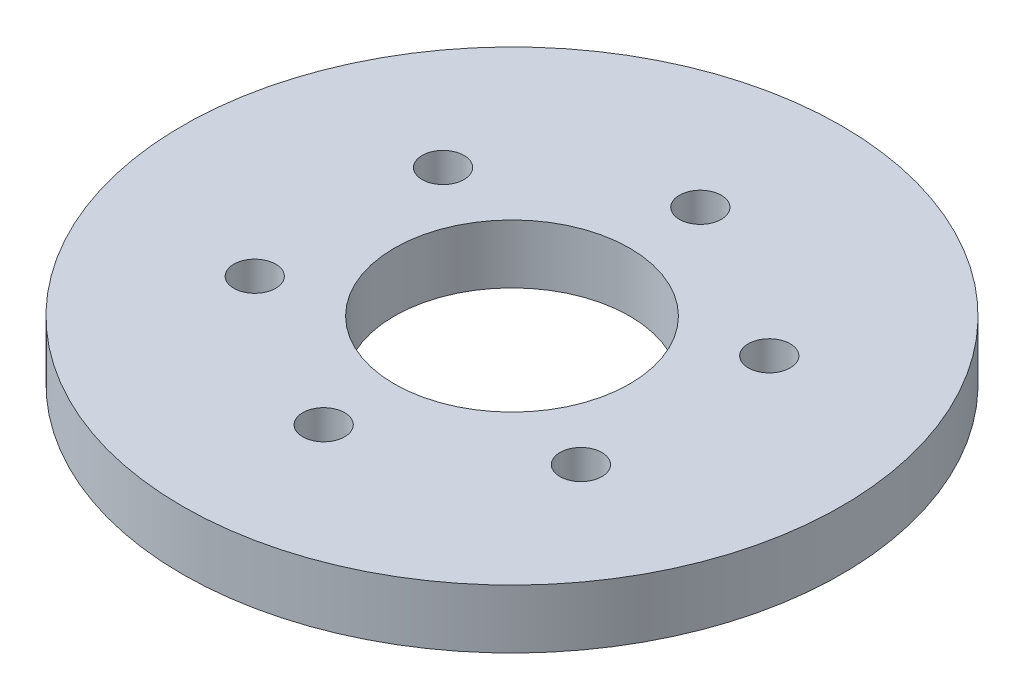
ISO-10303-21;
HEADER;
FILE_DESCRIPTION(('STEP AP214'),'2;1');
FILE_NAME('part.step','',(''),(''),'','','');
FILE_SCHEMA(('AUTOMOTIVE_DESIGN { 1 0 10303 214 1 1 1 1 }'));
ENDSEC;
DATA;
#1=APPLICATION_CONTEXT('core data for automotive mechanical design processes');
#2=APPLICATION_PROTOCOL_DEFINITION('international standard','automotive_design',2000,#1);
#3=PRODUCT_CONTEXT('',#1,'mechanical');
#4=PRODUCT('Part','Part','',(#3));
#5=PRODUCT_RELATED_PRODUCT_CATEGORY('part','',(#4));
#6=PRODUCT_DEFINITION_FORMATION('','',#4);
#7=PRODUCT_DEFINITION_CONTEXT('part definition',#1,'design');
#8=PRODUCT_DEFINITION('design','',#6,#7);
#9=PRODUCT_DEFINITION_SHAPE('','',#8);
#10=(LENGTH_UNIT() NAMED_UNIT(*) SI_UNIT(.MILLI.,.METRE.));
#11=(NAMED_UNIT(*) PLANE_ANGLE_UNIT() SI_UNIT($,.RADIAN.));
#12=(NAMED_UNIT(*) SI_UNIT($,.STERADIAN.) SOLID_ANGLE_UNIT());
#13=UNCERTAINTY_MEASURE_WITH_UNIT(LENGTH_MEASURE(1.E-05),#10,'distance_accuracy_value','');
#14=(GEOMETRIC_REPRESENTATION_CONTEXT(3) GLOBAL_UNCERTAINTY_ASSIGNED_CONTEXT((#13)) GLOBAL_UNIT_ASSIGNED_CONTEXT((#10,
#11,#12)) REPRESENTATION_CONTEXT('',''));
#15=CARTESIAN_POINT('',(0.,0.,0.));
#16=DIRECTION('',(0.,0.,1.));
#17=DIRECTION('',(1.,0.,0.));
#18=AXIS2_PLACEMENT_3D('',#15,#16,#17);
#19=CARTESIAN_POINT('',(0.,3.175,0.));
#20=DIRECTION('',(0.,1.,0.));
#21=DIRECTION('',(0.,0.,1.));
#22=AXIS2_PLACEMENT_3D('',#19,#20,#21);
#23=PLANE('',#22);
#24=CARTESIAN_POINT('',(0.,3.175,10.16));
#25=DIRECTION('',(0.,-1.,0.));
#26=DIRECTION('',(0.,0.,-1.));
#27=AXIS2_PLACEMENT_3D('',#24,#25,#26);
#28=CIRCLE('',#27,1.1303);
#29=CARTESIAN_POINT('',(0.,3.175,9.0297));
#30=VERTEX_POINT('',#29);
#31=EDGE_CURVE('E96',#30,#30,#28,.T.);
#32=ORIENTED_EDGE('',*,*,#31,.T.);
#33=EDGE_LOOP('',(#32));
#34=FACE_BOUND('',#33,.T.);
#35=CARTESIAN_POINT('',(8.7988181024499,3.175,5.08));
#36=DIRECTION('',(0.,-1.,0.));
#37=DIRECTION('',(0.,0.,-1.));
#38=AXIS2_PLACEMENT_3D('',#35,#36,#37);
#39=CIRCLE('',#38,1.1303);
#40=CARTESIAN_POINT('',(8.7988181024499,3.175,3.94970000000001));
#41=VERTEX_POINT('',#40);
#42=EDGE_CURVE('E88',#41,#41,#39,.T.);
#43=ORIENTED_EDGE('',*,*,#42,.T.);
#44=EDGE_LOOP('',(#43));
#45=FACE_BOUND('',#44,.T.);
#46=CARTESIAN_POINT('',(8.7988181024499,3.175,-5.08));
#47=DIRECTION('',(0.,-1.,0.));
#48=DIRECTION('',(0.,0.,-1.));
#49=AXIS2_PLACEMENT_3D('',#46,#47,#48);
#50=CIRCLE('',#49,1.1303);
#51=CARTESIAN_POINT('',(8.7988181024499,3.175,-6.2103));
#52=VERTEX_POINT('',#51);
#53=EDGE_CURVE('E80',#52,#52,#50,.T.);
#54=ORIENTED_EDGE('',*,*,#53,.T.);
#55=EDGE_LOOP('',(#54));
#56=FACE_BOUND('',#55,.T.);
#57=CARTESIAN_POINT('',(0.,3.175,-10.16));
#58=DIRECTION('',(0.,-1.,0.));
#59=DIRECTION('',(0.,0.,-1.));
#60=AXIS2_PLACEMENT_3D('',#57,#58,#59);
#61=CIRCLE('',#60,1.1303);
#62=CARTESIAN_POINT('',(0.,3.175,-11.2903));
#63=VERTEX_POINT('',#62);
#64=EDGE_CURVE('E73',#63,#63,#61,.T.);
#65=ORIENTED_EDGE('',*,*,#64,.T.);
#66=EDGE_LOOP('',(#65));
#67=FACE_BOUND('',#66,.T.);
#68=CARTESIAN_POINT('',(-8.7988181024499,3.175,-5.08));
#69=DIRECTION('',(0.,-1.,0.));
#70=DIRECTION('',(0.,0.,-1.));
#71=AXIS2_PLACEMENT_3D('',#68,#69,#70);
#72=CIRCLE('',#71,1.1303);
#73=CARTESIAN_POINT('',(-8.7988181024499,3.175,-6.2103));
#74=VERTEX_POINT('',#73);
#75=EDGE_CURVE('E66',#74,#74,#72,.T.);
#76=ORIENTED_EDGE('',*,*,#75,.T.);
#77=EDGE_LOOP('',(#76));
#78=FACE_BOUND('',#77,.T.);
#79=CARTESIAN_POINT('',(-8.7988181024499,3.175,5.08));
#80=DIRECTION('',(0.,-1.,0.));
#81=DIRECTION('',(0.,0.,-1.));
#82=AXIS2_PLACEMENT_3D('',#79,#80,#81);
#83=CIRCLE('',#82,1.1303);
#84=CARTESIAN_POINT('',(-8.7988181024499,3.175,3.9497));
#85=VERTEX_POINT('',#84);
#86=EDGE_CURVE('E55',#85,#85,#83,.T.);
#87=ORIENTED_EDGE('',*,*,#86,.T.);
#88=EDGE_LOOP('',(#87));
#89=FACE_BOUND('',#88,.T.);
#90=CARTESIAN_POINT('',(0.,3.175,0.));
#91=DIRECTION('',(0.,1.,0.));
#92=DIRECTION('',(0.,0.,1.));
#93=AXIS2_PLACEMENT_3D('',#90,#91,#92);
#94=CIRCLE('',#93,17.78);
#95=CARTESIAN_POINT('',(0.,3.175,17.78));
#96=VERTEX_POINT('',#95);
#97=EDGE_CURVE('E10',#96,#96,#94,.T.);
#98=ORIENTED_EDGE('',*,*,#97,.T.);
#99=EDGE_LOOP('',(#98));
#100=FACE_BOUND('',#99,.T.);
#101=CARTESIAN_POINT('',(0.,3.175,0.));
#102=DIRECTION('',(0.,1.,0.));
#103=DIRECTION('',(0.,0.,1.));
#104=AXIS2_PLACEMENT_3D('',#101,#102,#103);
#105=CIRCLE('',#104,6.35);
#106=CARTESIAN_POINT('',(0.,3.175,6.35));
#107=VERTEX_POINT('',#106);
#108=EDGE_CURVE('E49',#107,#107,#105,.T.);
#109=ORIENTED_EDGE('',*,*,#108,.F.);
#110=EDGE_LOOP('',(#109));
#111=FACE_BOUND('',#110,.T.);
#112=ADVANCED_FACE('F35',(#34,#45,#56,#67,#78,#89,#100,#111),#23,.T.);
#113=CARTESIAN_POINT('',(0.,0.,0.));
#114=DIRECTION('',(0.,1.,0.));
#115=DIRECTION('',(0.,0.,1.));
#116=AXIS2_PLACEMENT_3D('',#113,#114,#115);
#117=PLANE('',#116);
#118=CARTESIAN_POINT('',(0.,0.,10.16));
#119=DIRECTION('',(0.,-1.,0.));
#120=DIRECTION('',(0.,0.,-1.));
#121=AXIS2_PLACEMENT_3D('',#118,#119,#120);
#122=CIRCLE('',#121,1.1303);
#123=CARTESIAN_POINT('',(0.,0.,9.0297));
#124=VERTEX_POINT('',#123);
#125=EDGE_CURVE('E99',#124,#124,#122,.T.);
#126=ORIENTED_EDGE('',*,*,#125,.F.);
#127=EDGE_LOOP('',(#126));
#128=FACE_BOUND('',#127,.T.);
#129=CARTESIAN_POINT('',(8.7988181024499,0.,5.08));
#130=DIRECTION('',(0.,-1.,0.));
#131=DIRECTION('',(0.,0.,-1.));
#132=AXIS2_PLACEMENT_3D('',#129,#130,#131);
#133=CIRCLE('',#132,1.1303);
#134=CARTESIAN_POINT('',(8.7988181024499,0.,3.94970000000001));
#135=VERTEX_POINT('',#134);
#136=EDGE_CURVE('E92',#135,#135,#133,.T.);
#137=ORIENTED_EDGE('',*,*,#136,.F.);
#138=EDGE_LOOP('',(#137));
#139=FACE_BOUND('',#138,.T.);
#140=CARTESIAN_POINT('',(8.7988181024499,0.,-5.08));
#141=DIRECTION('',(0.,-1.,0.));
#142=DIRECTION('',(0.,0.,-1.));
#143=AXIS2_PLACEMENT_3D('',#140,#141,#142);
#144=CIRCLE('',#143,1.1303);
#145=CARTESIAN_POINT('',(8.7988181024499,0.,-6.2103));
#146=VERTEX_POINT('',#145);
#147=EDGE_CURVE('E84',#146,#146,#144,.T.);
#148=ORIENTED_EDGE('',*,*,#147,.F.);
#149=EDGE_LOOP('',(#148));
#150=FACE_BOUND('',#149,.T.);
#151=CARTESIAN_POINT('',(0.,0.,-10.16));
#152=DIRECTION('',(0.,-1.,0.));
#153=DIRECTION('',(0.,0.,-1.));
#154=AXIS2_PLACEMENT_3D('',#151,#152,#153);
#155=CIRCLE('',#154,1.1303);
#156=CARTESIAN_POINT('',(0.,0.,-11.2903));
#157=VERTEX_POINT('',#156);
#158=EDGE_CURVE('E76',#157,#157,#155,.T.);
#159=ORIENTED_EDGE('',*,*,#158,.F.);
#160=EDGE_LOOP('',(#159));
#161=FACE_BOUND('',#160,.T.);
#162=CARTESIAN_POINT('',(-8.7988181024499,0.,-5.08));
#163=DIRECTION('',(0.,-1.,0.));
#164=DIRECTION('',(0.,0.,-1.));
#165=AXIS2_PLACEMENT_3D('',#162,#163,#164);
#166=CIRCLE('',#165,1.1303);
#167=CARTESIAN_POINT('',(-8.7988181024499,0.,-6.2103));
#168=VERTEX_POINT('',#167);
#169=EDGE_CURVE('E70',#168,#168,#166,.T.);
#170=ORIENTED_EDGE('',*,*,#169,.F.);
#171=EDGE_LOOP('',(#170));
#172=FACE_BOUND('',#171,.T.);
#173=CARTESIAN_POINT('',(-8.7988181024499,0.,5.08));
#174=DIRECTION('',(0.,-1.,0.));
#175=DIRECTION('',(0.,0.,-1.));
#176=AXIS2_PLACEMENT_3D('',#173,#174,#175);
#177=CIRCLE('',#176,1.1303);
#178=CARTESIAN_POINT('',(-8.7988181024499,0.,3.9497));
#179=VERTEX_POINT('',#178);
#180=EDGE_CURVE('E62',#179,#179,#177,.T.);
#181=ORIENTED_EDGE('',*,*,#180,.F.);
#182=EDGE_LOOP('',(#181));
#183=FACE_BOUND('',#182,.T.);
#184=CARTESIAN_POINT('',(0.,0.,0.));
#185=DIRECTION('',(0.,1.,0.));
#186=DIRECTION('',(0.,0.,1.));
#187=AXIS2_PLACEMENT_3D('',#184,#185,#186);
#188=CIRCLE('',#187,17.78);
#189=CARTESIAN_POINT('',(0.,0.,17.78));
#190=VERTEX_POINT('',#189);
#191=EDGE_CURVE('E39',#190,#190,#188,.T.);
#192=ORIENTED_EDGE('',*,*,#191,.F.);
#193=EDGE_LOOP('',(#192));
#194=FACE_BOUND('',#193,.T.);
#195=CARTESIAN_POINT('',(0.,0.,0.));
#196=DIRECTION('',(0.,1.,0.));
#197=DIRECTION('',(0.,0.,1.));
#198=AXIS2_PLACEMENT_3D('',#195,#196,#197);
#199=CIRCLE('',#198,6.35);
#200=CARTESIAN_POINT('',(0.,0.,6.35));
#201=VERTEX_POINT('',#200);
#202=EDGE_CURVE('E51',#201,#201,#199,.T.);
#203=ORIENTED_EDGE('',*,*,#202,.T.);
#204=EDGE_LOOP('',(#203));
#205=FACE_BOUND('',#204,.T.);
#206=ADVANCED_FACE('F105',(#128,#139,#150,#161,#172,#183,#194,#205),#117,.F.);
#207=CARTESIAN_POINT('',(0.,3.175,0.));
#208=DIRECTION('',(0.,-1.,0.));
#209=DIRECTION('',(0.,0.,-1.));
#210=AXIS2_PLACEMENT_3D('',#207,#208,#209);
#211=CYLINDRICAL_SURFACE('',#210,17.78);
#212=ORIENTED_EDGE('',*,*,#97,.F.);
#213=EDGE_LOOP('',(#212));
#214=FACE_BOUND('',#213,.T.);
#215=ORIENTED_EDGE('',*,*,#191,.T.);
#216=EDGE_LOOP('',(#215));
#217=FACE_BOUND('',#216,.T.);
#218=ADVANCED_FACE('F37',(#214,#217),#211,.T.);
#219=CARTESIAN_POINT('',(0.,3.175,0.));
#220=DIRECTION('',(0.,-1.,0.));
#221=DIRECTION('',(0.,0.,-1.));
#222=AXIS2_PLACEMENT_3D('',#219,#220,#221);
#223=CYLINDRICAL_SURFACE('',#222,6.35);
#224=ORIENTED_EDGE('',*,*,#108,.T.);
#225=EDGE_LOOP('',(#224));
#226=FACE_BOUND('',#225,.T.);
#227=ORIENTED_EDGE('',*,*,#202,.F.);
#228=EDGE_LOOP('',(#227));
#229=FACE_BOUND('',#228,.T.);
#230=ADVANCED_FACE('F122',(#226,#229),#223,.F.);
#231=CARTESIAN_POINT('',(-8.7988181024499,0.,5.08));
#232=DIRECTION('',(0.,-1.,0.));
#233=DIRECTION('',(0.,0.,-1.));
#234=AXIS2_PLACEMENT_3D('',#231,#232,#233);
#235=CYLINDRICAL_SURFACE('',#234,1.1303);
#236=ORIENTED_EDGE('',*,*,#86,.F.);
#237=EDGE_LOOP('',(#236));
#238=FACE_BOUND('',#237,.T.);
#239=ORIENTED_EDGE('',*,*,#180,.T.);
#240=EDGE_LOOP('',(#239));
#241=FACE_BOUND('',#240,.T.);
#242=ADVANCED_FACE('F124',(#238,#241),#235,.F.);
#243=CARTESIAN_POINT('',(-8.7988181024499,0.,-5.08));
#244=DIRECTION('',(0.,-1.,0.));
#245=DIRECTION('',(0.,0.,-1.));
#246=AXIS2_PLACEMENT_3D('',#243,#244,#245);
#247=CYLINDRICAL_SURFACE('',#246,1.1303);
#248=ORIENTED_EDGE('',*,*,#75,.F.);
#249=EDGE_LOOP('',(#248));
#250=FACE_BOUND('',#249,.T.);
#251=ORIENTED_EDGE('',*,*,#169,.T.);
#252=EDGE_LOOP('',(#251));
#253=FACE_BOUND('',#252,.T.);
#254=ADVANCED_FACE('F131',(#250,#253),#247,.F.);
#255=CARTESIAN_POINT('',(0.,0.,-10.16));
#256=DIRECTION('',(0.,-1.,0.));
#257=DIRECTION('',(0.,0.,-1.));
#258=AXIS2_PLACEMENT_3D('',#255,#256,#257);
#259=CYLINDRICAL_SURFACE('',#258,1.1303);
#260=ORIENTED_EDGE('',*,*,#64,.F.);
#261=EDGE_LOOP('',(#260));
#262=FACE_BOUND('',#261,.T.);
#263=ORIENTED_EDGE('',*,*,#158,.T.);
#264=EDGE_LOOP('',(#263));
#265=FACE_BOUND('',#264,.T.);
#266=ADVANCED_FACE('F157',(#262,#265),#259,.F.);
#267=CARTESIAN_POINT('',(8.7988181024499,0.,-5.08));
#268=DIRECTION('',(0.,-1.,0.));
#269=DIRECTION('',(0.,0.,-1.));
#270=AXIS2_PLACEMENT_3D('',#267,#268,#269);
#271=CYLINDRICAL_SURFACE('',#270,1.1303);
#272=ORIENTED_EDGE('',*,*,#53,.F.);
#273=EDGE_LOOP('',(#272));
#274=FACE_BOUND('',#273,.T.);
#275=ORIENTED_EDGE('',*,*,#147,.T.);
#276=EDGE_LOOP('',(#275));
#277=FACE_BOUND('',#276,.T.);
#278=ADVANCED_FACE('F162',(#274,#277),#271,.F.);
#279=CARTESIAN_POINT('',(8.7988181024499,0.,5.08));
#280=DIRECTION('',(0.,-1.,0.));
#281=DIRECTION('',(0.,0.,-1.));
#282=AXIS2_PLACEMENT_3D('',#279,#280,#281);
#283=CYLINDRICAL_SURFACE('',#282,1.1303);
#284=ORIENTED_EDGE('',*,*,#42,.F.);
#285=EDGE_LOOP('',(#284));
#286=FACE_BOUND('',#285,.T.);
#287=ORIENTED_EDGE('',*,*,#136,.T.);
#288=EDGE_LOOP('',(#287));
#289=FACE_BOUND('',#288,.T.);
#290=ADVANCED_FACE('F168',(#286,#289),#283,.F.);
#291=CARTESIAN_POINT('',(0.,0.,10.16));
#292=DIRECTION('',(0.,-1.,0.));
#293=DIRECTION('',(0.,0.,-1.));
#294=AXIS2_PLACEMENT_3D('',#291,#292,#293);
#295=CYLINDRICAL_SURFACE('',#294,1.1303);
#296=ORIENTED_EDGE('',*,*,#31,.F.);
#297=EDGE_LOOP('',(#296));
#298=FACE_BOUND('',#297,.T.);
#299=ORIENTED_EDGE('',*,*,#125,.T.);
#300=EDGE_LOOP('',(#299));
#301=FACE_BOUND('',#300,.T.);
#302=ADVANCED_FACE('F103',(#298,#301),#295,.F.);
#303=CLOSED_SHELL('',(#112,#206,#218,#230,#242,#254,#266,#278,#290,#302));
#304=MANIFOLD_SOLID_BREP('B2',#303);
#305=ADVANCED_BREP_SHAPE_REPRESENTATION('',(#18,#304),#14);
#306=SHAPE_DEFINITION_REPRESENTATION(#9,#305);
ENDSEC;
END-ISO-10303-21;
